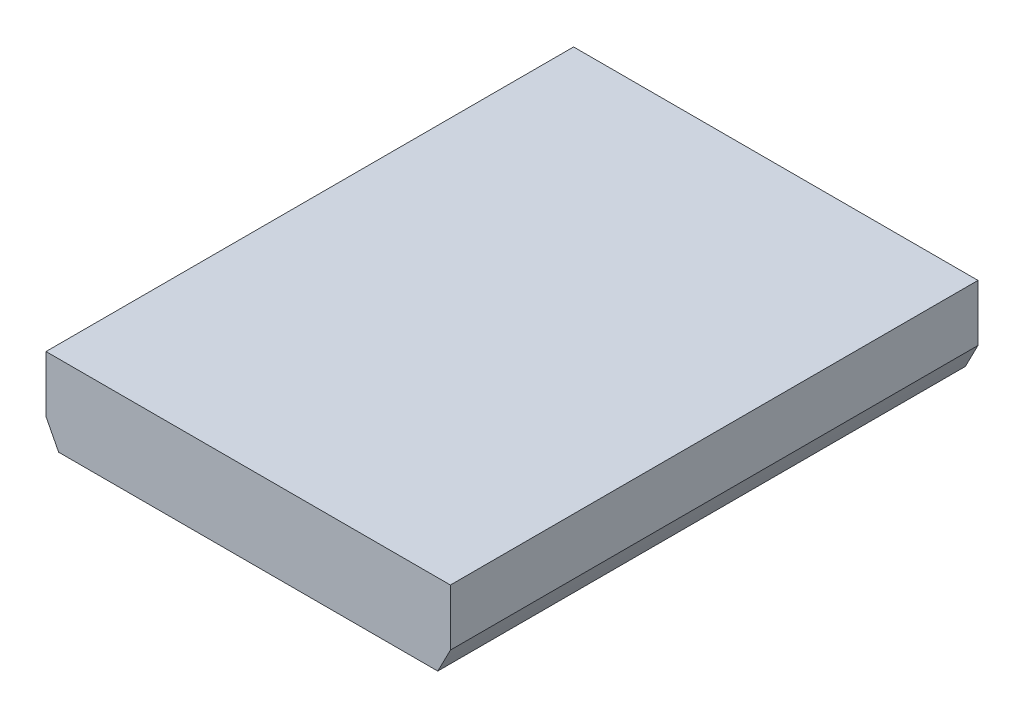
ISO-10303-21;
HEADER;
FILE_DESCRIPTION(('STEP AP214'),'2;1');
FILE_NAME('part.step','',(''),(''),'','','');
FILE_SCHEMA(('AUTOMOTIVE_DESIGN { 1 0 10303 214 1 1 1 1 }'));
ENDSEC;
DATA;
#1=APPLICATION_CONTEXT('core data for automotive mechanical design processes');
#2=APPLICATION_PROTOCOL_DEFINITION('international standard','automotive_design',2000,#1);
#3=PRODUCT_CONTEXT('',#1,'mechanical');
#4=PRODUCT('Part','Part','',(#3));
#5=PRODUCT_RELATED_PRODUCT_CATEGORY('part','',(#4));
#6=PRODUCT_DEFINITION_FORMATION('','',#4);
#7=PRODUCT_DEFINITION_CONTEXT('part definition',#1,'design');
#8=PRODUCT_DEFINITION('design','',#6,#7);
#9=PRODUCT_DEFINITION_SHAPE('','',#8);
#10=(LENGTH_UNIT() NAMED_UNIT(*) SI_UNIT(.MILLI.,.METRE.));
#11=(NAMED_UNIT(*) PLANE_ANGLE_UNIT() SI_UNIT($,.RADIAN.));
#12=(NAMED_UNIT(*) SI_UNIT($,.STERADIAN.) SOLID_ANGLE_UNIT());
#13=UNCERTAINTY_MEASURE_WITH_UNIT(LENGTH_MEASURE(1.E-05),#10,'distance_accuracy_value','');
#14=(GEOMETRIC_REPRESENTATION_CONTEXT(3) GLOBAL_UNCERTAINTY_ASSIGNED_CONTEXT((#13)) GLOBAL_UNIT_ASSIGNED_CONTEXT((#10,
#11,#12)) REPRESENTATION_CONTEXT('',''));
#15=CARTESIAN_POINT('',(0.,0.,0.));
#16=DIRECTION('',(0.,0.,1.));
#17=DIRECTION('',(1.,0.,0.));
#18=AXIS2_PLACEMENT_3D('',#15,#16,#17);
#19=CARTESIAN_POINT('',(-127.000000000214,127.000000000428,331.382));
#20=CARTESIAN_POINT('',(-3.79340656109228E-11,-127.000000000353,331.382));
#21=CARTESIAN_POINT('',(127.000000000138,127.000000000277,331.382));
#22=B_SPLINE_CURVE_WITH_KNOTS('',2,(#19,#20,#21),.UNSPECIFIED.,.F.,.F.,(3,3),
(0.0560283962320779,0.943971603767657),.UNSPECIFIED.);
#23=DIRECTION('',(0.,0.,-1.));
#24=VECTOR('',#23,1.);
#25=SURFACE_OF_LINEAR_EXTRUSION('',#22,#24);
#26=CARTESIAN_POINT('',(-127.000000000214,127.000000000428,0.));
#27=CARTESIAN_POINT('',(-3.79340656109228E-11,-127.000000000353,0.));
#28=CARTESIAN_POINT('',(127.000000000138,127.000000000277,0.));
#29=B_SPLINE_CURVE_WITH_KNOTS('',2,(#26,#27,#28),.UNSPECIFIED.,.F.,.F.,(3,3),
(0.0560283962320779,0.943971603767657),.UNSPECIFIED.);
#30=CARTESIAN_POINT('',(-127.000000000171,127.000000000343,0.));
#31=VERTEX_POINT('',#30);
#32=CARTESIAN_POINT('',(-119.051249468448,111.599999999989,0.));
#33=VERTEX_POINT('',#32);
#34=EDGE_CURVE('E135',#31,#33,#29,.T.);
#35=ORIENTED_EDGE('',*,*,#34,.T.);
#36=DIRECTION('',(0.,0.,-1.));
#37=VECTOR('',#36,1.);
#38=CARTESIAN_POINT('',(-119.051249468454,111.6,331.382));
#39=LINE('',#38,#37);
#40=CARTESIAN_POINT('',(-119.051249468448,111.6,331.382));
#41=VERTEX_POINT('',#40);
#42=EDGE_CURVE('E49',#33,#41,#39,.F.);
#43=ORIENTED_EDGE('',*,*,#42,.T.);
#44=CARTESIAN_POINT('',(-127.000000000171,127.000000000343,331.382));
#45=VERTEX_POINT('',#44);
#46=EDGE_CURVE('E151',#45,#41,#22,.T.);
#47=ORIENTED_EDGE('',*,*,#46,.F.);
#48=DIRECTION('',(0.,0.,-1.));
#49=VECTOR('',#48,1.);
#50=CARTESIAN_POINT('',(-127.000000000171,127.000000000343,331.382));
#51=LINE('',#50,#49);
#52=EDGE_CURVE('E149',#45,#31,#51,.T.);
#53=ORIENTED_EDGE('',*,*,#52,.T.);
#54=EDGE_LOOP('',(#35,#43,#47,#53));
#55=FACE_BOUND('',#54,.T.);
#56=ADVANCED_FACE('F33',(#55),#25,.F.);
#57=CARTESIAN_POINT('',(119.051249468448,111.6,331.382));
#58=VERTEX_POINT('',#57);
#59=CARTESIAN_POINT('',(127.000000000094,127.000000000343,331.382));
#60=VERTEX_POINT('',#59);
#61=EDGE_CURVE('E145',#58,#60,#22,.T.);
#62=ORIENTED_EDGE('',*,*,#61,.F.);
#63=DIRECTION('',(0.,0.,-1.));
#64=VECTOR('',#63,1.);
#65=CARTESIAN_POINT('',(119.051249468454,111.6,331.382));
#66=LINE('',#65,#64);
#67=CARTESIAN_POINT('',(119.051249468448,111.6,0.));
#68=VERTEX_POINT('',#67);
#69=EDGE_CURVE('E198',#58,#68,#66,.T.);
#70=ORIENTED_EDGE('',*,*,#69,.T.);
#71=CARTESIAN_POINT('',(127.000000000094,127.000000000343,0.));
#72=VERTEX_POINT('',#71);
#73=EDGE_CURVE('E146',#68,#72,#29,.T.);
#74=ORIENTED_EDGE('',*,*,#73,.T.);
#75=DIRECTION('',(0.,0.,-1.));
#76=VECTOR('',#75,1.);
#77=CARTESIAN_POINT('',(127.000000000094,127.000000000343,331.382));
#78=LINE('',#77,#76);
#79=EDGE_CURVE('E42',#60,#72,#78,.T.);
#80=ORIENTED_EDGE('',*,*,#79,.F.);
#81=EDGE_LOOP('',(#62,#70,#74,#80));
#82=FACE_BOUND('',#81,.T.);
#83=ADVANCED_FACE('F35',(#82),#25,.F.);
#84=CARTESIAN_POINT('',(-3.79349329726608E-11,0.,331.382));
#85=DIRECTION('',(0.,0.,-1.));
#86=DIRECTION('',(-1.,0.,0.));
#87=AXIS2_PLACEMENT_3D('',#84,#85,#86);
#88=PLANE('',#87);
#89=ORIENTED_EDGE('',*,*,#46,.T.);
#90=DIRECTION('',(1.,0.,0.));
#91=VECTOR('',#90,1.);
#92=CARTESIAN_POINT('',(120.,111.6,331.382));
#93=LINE('',#92,#91);
#94=EDGE_CURVE('E176',#41,#58,#93,.T.);
#95=ORIENTED_EDGE('',*,*,#94,.T.);
#96=ORIENTED_EDGE('',*,*,#61,.T.);
#97=DIRECTION('',(0.,1.,0.));
#98=VECTOR('',#97,1.);
#99=CARTESIAN_POINT('',(127.000000000094,127.000000000343,331.382));
#100=LINE('',#99,#98);
#101=CARTESIAN_POINT('',(127.000000000094,162.400000000343,331.382));
#102=VERTEX_POINT('',#101);
#103=EDGE_CURVE('E165',#60,#102,#100,.T.);
#104=ORIENTED_EDGE('',*,*,#103,.T.);
#105=DIRECTION('',(-1.,0.,0.));
#106=VECTOR('',#105,1.);
#107=CARTESIAN_POINT('',(-127.000000000171,162.400000000343,331.382));
#108=LINE('',#107,#106);
#109=CARTESIAN_POINT('',(-127.000000000171,162.400000000343,331.382));
#110=VERTEX_POINT('',#109);
#111=EDGE_CURVE('E159',#102,#110,#108,.T.);
#112=ORIENTED_EDGE('',*,*,#111,.T.);
#113=DIRECTION('',(0.,-1.,0.));
#114=VECTOR('',#113,1.);
#115=CARTESIAN_POINT('',(-127.000000000171,127.000000000343,331.382));
#116=LINE('',#115,#114);
#117=EDGE_CURVE('E170',#110,#45,#116,.T.);
#118=ORIENTED_EDGE('',*,*,#117,.T.);
#119=EDGE_LOOP('',(#89,#95,#96,#104,#112,#118));
#120=FACE_BOUND('',#119,.T.);
#121=ADVANCED_FACE('F272',(#120),#88,.F.);
#122=CARTESIAN_POINT('',(-3.79349329726608E-11,0.,0.));
#123=DIRECTION('',(0.,0.,-1.));
#124=DIRECTION('',(-1.,0.,0.));
#125=AXIS2_PLACEMENT_3D('',#122,#123,#124);
#126=PLANE('',#125);
#127=DIRECTION('',(1.,0.,0.));
#128=VECTOR('',#127,1.);
#129=CARTESIAN_POINT('',(120.,111.6,0.));
#130=LINE('',#129,#128);
#131=EDGE_CURVE('E143',#33,#68,#130,.T.);
#132=ORIENTED_EDGE('',*,*,#131,.F.);
#133=ORIENTED_EDGE('',*,*,#34,.F.);
#134=DIRECTION('',(0.,-1.,0.));
#135=VECTOR('',#134,1.);
#136=CARTESIAN_POINT('',(-127.000000000171,127.000000000343,0.));
#137=LINE('',#136,#135);
#138=CARTESIAN_POINT('',(-127.000000000171,162.400000000343,0.));
#139=VERTEX_POINT('',#138);
#140=EDGE_CURVE('E140',#139,#31,#137,.T.);
#141=ORIENTED_EDGE('',*,*,#140,.F.);
#142=DIRECTION('',(-1.,0.,0.));
#143=VECTOR('',#142,1.);
#144=CARTESIAN_POINT('',(-127.000000000171,162.400000000343,0.));
#145=LINE('',#144,#143);
#146=CARTESIAN_POINT('',(127.000000000094,162.400000000343,0.));
#147=VERTEX_POINT('',#146);
#148=EDGE_CURVE('E162',#147,#139,#145,.T.);
#149=ORIENTED_EDGE('',*,*,#148,.F.);
#150=DIRECTION('',(0.,1.,0.));
#151=VECTOR('',#150,1.);
#152=CARTESIAN_POINT('',(127.000000000094,127.000000000343,0.));
#153=LINE('',#152,#151);
#154=EDGE_CURVE('E158',#72,#147,#153,.T.);
#155=ORIENTED_EDGE('',*,*,#154,.F.);
#156=ORIENTED_EDGE('',*,*,#73,.F.);
#157=EDGE_LOOP('',(#132,#133,#141,#149,#155,#156));
#158=FACE_BOUND('',#157,.T.);
#159=ADVANCED_FACE('F137',(#158),#126,.T.);
#160=CARTESIAN_POINT('',(-33.,-3.79141162909491E-11,21.8455));
#161=DIRECTION('',(-1.,0.,0.));
#162=DIRECTION('',(0.,0.,1.));
#163=AXIS2_PLACEMENT_3D('',#160,#161,#162);
#164=PLANE('',#163);
#165=DIRECTION('',(0.,1.,0.));
#166=VECTOR('',#165,1.);
#167=CARTESIAN_POINT('',(-33.,-3.79141162909491E-11,143.8455));
#168=LINE('',#167,#166);
#169=CARTESIAN_POINT('',(-33.,111.6,143.8455));
#170=VERTEX_POINT('',#169);
#171=CARTESIAN_POINT('',(-33.,127.000000000343,143.8455));
#172=VERTEX_POINT('',#171);
#173=EDGE_CURVE('E238',#170,#172,#168,.T.);
#174=ORIENTED_EDGE('',*,*,#173,.F.);
#175=DIRECTION('',(0.,0.,-1.));
#176=VECTOR('',#175,1.);
#177=CARTESIAN_POINT('',(-33.,111.6,21.8455));
#178=LINE('',#177,#176);
#179=CARTESIAN_POINT('',(-33.,111.6,21.8455));
#180=VERTEX_POINT('',#179);
#181=EDGE_CURVE('E57',#170,#180,#178,.T.);
#182=ORIENTED_EDGE('',*,*,#181,.T.);
#183=DIRECTION('',(0.,1.,0.));
#184=VECTOR('',#183,1.);
#185=CARTESIAN_POINT('',(-33.,-3.79141162909491E-11,21.8455));
#186=LINE('',#185,#184);
#187=CARTESIAN_POINT('',(-33.,127.000000000343,21.8455));
#188=VERTEX_POINT('',#187);
#189=EDGE_CURVE('E239',#180,#188,#186,.T.);
#190=ORIENTED_EDGE('',*,*,#189,.T.);
#191=DIRECTION('',(0.,0.,1.));
#192=VECTOR('',#191,1.);
#193=CARTESIAN_POINT('',(-33.,127.000000000343,21.8455));
#194=LINE('',#193,#192);
#195=EDGE_CURVE('E218',#188,#172,#194,.T.);
#196=ORIENTED_EDGE('',*,*,#195,.T.);
#197=EDGE_LOOP('',(#174,#182,#190,#196));
#198=FACE_BOUND('',#197,.T.);
#199=ADVANCED_FACE('F302',(#198),#164,.F.);
#200=CARTESIAN_POINT('',(-33.,-3.79141162909491E-11,21.8455));
#201=DIRECTION('',(0.,0.,-1.));
#202=DIRECTION('',(-1.,0.,0.));
#203=AXIS2_PLACEMENT_3D('',#200,#201,#202);
#204=PLANE('',#203);
#205=ORIENTED_EDGE('',*,*,#189,.F.);
#206=DIRECTION('',(1.,0.,0.));
#207=VECTOR('',#206,1.);
#208=CARTESIAN_POINT('',(-33.,111.6,21.8455));
#209=LINE('',#208,#207);
#210=CARTESIAN_POINT('',(33.,111.6,21.8455));
#211=VERTEX_POINT('',#210);
#212=EDGE_CURVE('E194',#180,#211,#209,.T.);
#213=ORIENTED_EDGE('',*,*,#212,.T.);
#214=DIRECTION('',(0.,1.,0.));
#215=VECTOR('',#214,1.);
#216=CARTESIAN_POINT('',(33.,-3.79141162909491E-11,21.8455));
#217=LINE('',#216,#215);
#218=CARTESIAN_POINT('',(33.,127.000000000343,21.8455));
#219=VERTEX_POINT('',#218);
#220=EDGE_CURVE('E242',#211,#219,#217,.T.);
#221=ORIENTED_EDGE('',*,*,#220,.T.);
#222=DIRECTION('',(-1.,0.,0.));
#223=VECTOR('',#222,1.);
#224=CARTESIAN_POINT('',(-33.,127.000000000343,21.8455));
#225=LINE('',#224,#223);
#226=EDGE_CURVE('E235',#219,#188,#225,.T.);
#227=ORIENTED_EDGE('',*,*,#226,.T.);
#228=EDGE_LOOP('',(#205,#213,#221,#227));
#229=FACE_BOUND('',#228,.T.);
#230=ADVANCED_FACE('F306',(#229),#204,.F.);
#231=CARTESIAN_POINT('',(33.,-3.79141162909491E-11,21.8455));
#232=DIRECTION('',(1.,0.,0.));
#233=DIRECTION('',(0.,0.,-1.));
#234=AXIS2_PLACEMENT_3D('',#231,#232,#233);
#235=PLANE('',#234);
#236=ORIENTED_EDGE('',*,*,#220,.F.);
#237=DIRECTION('',(0.,0.,1.));
#238=VECTOR('',#237,1.);
#239=CARTESIAN_POINT('',(33.,111.6,21.8455));
#240=LINE('',#239,#238);
#241=CARTESIAN_POINT('',(33.,111.6,143.8455));
#242=VERTEX_POINT('',#241);
#243=EDGE_CURVE('E191',#211,#242,#240,.T.);
#244=ORIENTED_EDGE('',*,*,#243,.T.);
#245=DIRECTION('',(0.,1.,0.));
#246=VECTOR('',#245,1.);
#247=CARTESIAN_POINT('',(33.,-3.79141162909491E-11,143.8455));
#248=LINE('',#247,#246);
#249=CARTESIAN_POINT('',(33.,127.000000000343,143.8455));
#250=VERTEX_POINT('',#249);
#251=EDGE_CURVE('E245',#242,#250,#248,.T.);
#252=ORIENTED_EDGE('',*,*,#251,.T.);
#253=DIRECTION('',(0.,0.,-1.));
#254=VECTOR('',#253,1.);
#255=CARTESIAN_POINT('',(33.,127.000000000343,21.8455));
#256=LINE('',#255,#254);
#257=EDGE_CURVE('E232',#250,#219,#256,.T.);
#258=ORIENTED_EDGE('',*,*,#257,.T.);
#259=EDGE_LOOP('',(#236,#244,#252,#258));
#260=FACE_BOUND('',#259,.T.);
#261=ADVANCED_FACE('F312',(#260),#235,.F.);
#262=CARTESIAN_POINT('',(-33.,-3.79141162909491E-11,143.8455));
#263=DIRECTION('',(0.,0.,1.));
#264=DIRECTION('',(1.,0.,0.));
#265=AXIS2_PLACEMENT_3D('',#262,#263,#264);
#266=PLANE('',#265);
#267=ORIENTED_EDGE('',*,*,#251,.F.);
#268=DIRECTION('',(-1.,0.,0.));
#269=VECTOR('',#268,1.);
#270=CARTESIAN_POINT('',(-33.,111.6,143.8455));
#271=LINE('',#270,#269);
#272=EDGE_CURVE('E189',#242,#170,#271,.T.);
#273=ORIENTED_EDGE('',*,*,#272,.T.);
#274=ORIENTED_EDGE('',*,*,#173,.T.);
#275=DIRECTION('',(1.,0.,0.));
#276=VECTOR('',#275,1.);
#277=CARTESIAN_POINT('',(-33.,127.000000000343,143.8455));
#278=LINE('',#277,#276);
#279=EDGE_CURVE('E229',#172,#250,#278,.T.);
#280=ORIENTED_EDGE('',*,*,#279,.T.);
#281=EDGE_LOOP('',(#267,#273,#274,#280));
#282=FACE_BOUND('',#281,.T.);
#283=ADVANCED_FACE('F308',(#282),#266,.F.);
#284=CARTESIAN_POINT('',(-33.,-3.79141162909491E-11,187.5365));
#285=DIRECTION('',(-1.,0.,0.));
#286=DIRECTION('',(0.,0.,1.));
#287=AXIS2_PLACEMENT_3D('',#284,#285,#286);
#288=PLANE('',#287);
#289=DIRECTION('',(0.,1.,0.));
#290=VECTOR('',#289,1.);
#291=CARTESIAN_POINT('',(-33.,-3.79141162909491E-11,309.5365));
#292=LINE('',#291,#290);
#293=CARTESIAN_POINT('',(-33.,111.6,309.5365));
#294=VERTEX_POINT('',#293);
#295=CARTESIAN_POINT('',(-33.,127.000000000343,309.5365));
#296=VERTEX_POINT('',#295);
#297=EDGE_CURVE('E214',#294,#296,#292,.T.);
#298=ORIENTED_EDGE('',*,*,#297,.F.);
#299=DIRECTION('',(0.,0.,-1.));
#300=VECTOR('',#299,1.);
#301=CARTESIAN_POINT('',(-33.,111.6,187.5365));
#302=LINE('',#301,#300);
#303=CARTESIAN_POINT('',(-33.,111.6,187.5365));
#304=VERTEX_POINT('',#303);
#305=EDGE_CURVE('E186',#294,#304,#302,.T.);
#306=ORIENTED_EDGE('',*,*,#305,.T.);
#307=DIRECTION('',(0.,1.,0.));
#308=VECTOR('',#307,1.);
#309=CARTESIAN_POINT('',(-33.,-3.79141162909491E-11,187.5365));
#310=LINE('',#309,#308);
#311=CARTESIAN_POINT('',(-33.,127.000000000343,187.5365));
#312=VERTEX_POINT('',#311);
#313=EDGE_CURVE('E215',#304,#312,#310,.T.);
#314=ORIENTED_EDGE('',*,*,#313,.T.);
#315=DIRECTION('',(0.,0.,1.));
#316=VECTOR('',#315,1.);
#317=CARTESIAN_POINT('',(-33.,127.000000000343,187.5365));
#318=LINE('',#317,#316);
#319=EDGE_CURVE('E202',#312,#296,#318,.T.);
#320=ORIENTED_EDGE('',*,*,#319,.T.);
#321=EDGE_LOOP('',(#298,#306,#314,#320));
#322=FACE_BOUND('',#321,.T.);
#323=ADVANCED_FACE('F311',(#322),#288,.F.);
#324=CARTESIAN_POINT('',(-33.,-3.79141162909491E-11,187.5365));
#325=DIRECTION('',(0.,0.,-1.));
#326=DIRECTION('',(-1.,0.,0.));
#327=AXIS2_PLACEMENT_3D('',#324,#325,#326);
#328=PLANE('',#327);
#329=ORIENTED_EDGE('',*,*,#313,.F.);
#330=DIRECTION('',(1.,0.,0.));
#331=VECTOR('',#330,1.);
#332=CARTESIAN_POINT('',(-33.,111.6,187.5365));
#333=LINE('',#332,#331);
#334=CARTESIAN_POINT('',(33.,111.6,187.5365));
#335=VERTEX_POINT('',#334);
#336=EDGE_CURVE('E183',#304,#335,#333,.T.);
#337=ORIENTED_EDGE('',*,*,#336,.T.);
#338=DIRECTION('',(0.,1.,0.));
#339=VECTOR('',#338,1.);
#340=CARTESIAN_POINT('',(33.,-3.79141162909491E-11,187.5365));
#341=LINE('',#340,#339);
#342=CARTESIAN_POINT('',(33.,127.000000000343,187.5365));
#343=VERTEX_POINT('',#342);
#344=EDGE_CURVE('E219',#335,#343,#341,.T.);
#345=ORIENTED_EDGE('',*,*,#344,.T.);
#346=DIRECTION('',(-1.,0.,0.));
#347=VECTOR('',#346,1.);
#348=CARTESIAN_POINT('',(-33.,127.000000000343,187.5365));
#349=LINE('',#348,#347);
#350=EDGE_CURVE('E211',#343,#312,#349,.T.);
#351=ORIENTED_EDGE('',*,*,#350,.T.);
#352=EDGE_LOOP('',(#329,#337,#345,#351));
#353=FACE_BOUND('',#352,.T.);
#354=ADVANCED_FACE('F321',(#353),#328,.F.);
#355=CARTESIAN_POINT('',(33.,-3.79141162909491E-11,187.5365));
#356=DIRECTION('',(1.,0.,0.));
#357=DIRECTION('',(0.,0.,-1.));
#358=AXIS2_PLACEMENT_3D('',#355,#356,#357);
#359=PLANE('',#358);
#360=ORIENTED_EDGE('',*,*,#344,.F.);
#361=DIRECTION('',(0.,0.,1.));
#362=VECTOR('',#361,1.);
#363=CARTESIAN_POINT('',(33.,111.6,187.5365));
#364=LINE('',#363,#362);
#365=CARTESIAN_POINT('',(33.,111.6,309.5365));
#366=VERTEX_POINT('',#365);
#367=EDGE_CURVE('E179',#335,#366,#364,.T.);
#368=ORIENTED_EDGE('',*,*,#367,.T.);
#369=DIRECTION('',(0.,1.,0.));
#370=VECTOR('',#369,1.);
#371=CARTESIAN_POINT('',(33.,-3.79141162909491E-11,309.5365));
#372=LINE('',#371,#370);
#373=CARTESIAN_POINT('',(33.,127.000000000343,309.5365));
#374=VERTEX_POINT('',#373);
#375=EDGE_CURVE('E222',#366,#374,#372,.T.);
#376=ORIENTED_EDGE('',*,*,#375,.T.);
#377=DIRECTION('',(0.,0.,-1.));
#378=VECTOR('',#377,1.);
#379=CARTESIAN_POINT('',(33.,127.000000000343,187.5365));
#380=LINE('',#379,#378);
#381=EDGE_CURVE('E208',#374,#343,#380,.T.);
#382=ORIENTED_EDGE('',*,*,#381,.T.);
#383=EDGE_LOOP('',(#360,#368,#376,#382));
#384=FACE_BOUND('',#383,.T.);
#385=ADVANCED_FACE('F286',(#384),#359,.F.);
#386=CARTESIAN_POINT('',(-33.,-3.79141162909491E-11,309.5365));
#387=DIRECTION('',(0.,0.,1.));
#388=DIRECTION('',(1.,0.,0.));
#389=AXIS2_PLACEMENT_3D('',#386,#387,#388);
#390=PLANE('',#389);
#391=ORIENTED_EDGE('',*,*,#375,.F.);
#392=DIRECTION('',(-1.,0.,0.));
#393=VECTOR('',#392,1.);
#394=CARTESIAN_POINT('',(-33.,111.6,309.5365));
#395=LINE('',#394,#393);
#396=EDGE_CURVE('E11',#366,#294,#395,.T.);
#397=ORIENTED_EDGE('',*,*,#396,.T.);
#398=ORIENTED_EDGE('',*,*,#297,.T.);
#399=DIRECTION('',(1.,0.,0.));
#400=VECTOR('',#399,1.);
#401=CARTESIAN_POINT('',(-33.,127.000000000343,309.5365));
#402=LINE('',#401,#400);
#403=EDGE_CURVE('E205',#296,#374,#402,.T.);
#404=ORIENTED_EDGE('',*,*,#403,.T.);
#405=EDGE_LOOP('',(#391,#397,#398,#404));
#406=FACE_BOUND('',#405,.T.);
#407=ADVANCED_FACE('F276',(#406),#390,.F.);
#408=CARTESIAN_POINT('',(120.,111.6,331.382));
#409=DIRECTION('',(0.,1.,0.));
#410=DIRECTION('',(0.,0.,1.));
#411=AXIS2_PLACEMENT_3D('',#408,#409,#410);
#412=PLANE('',#411);
#413=ORIENTED_EDGE('',*,*,#396,.F.);
#414=ORIENTED_EDGE('',*,*,#367,.F.);
#415=ORIENTED_EDGE('',*,*,#336,.F.);
#416=ORIENTED_EDGE('',*,*,#305,.F.);
#417=EDGE_LOOP('',(#413,#414,#415,#416));
#418=FACE_BOUND('',#417,.T.);
#419=ORIENTED_EDGE('',*,*,#272,.F.);
#420=ORIENTED_EDGE('',*,*,#243,.F.);
#421=ORIENTED_EDGE('',*,*,#212,.F.);
#422=ORIENTED_EDGE('',*,*,#181,.F.);
#423=EDGE_LOOP('',(#419,#420,#421,#422));
#424=FACE_BOUND('',#423,.T.);
#425=ORIENTED_EDGE('',*,*,#131,.T.);
#426=ORIENTED_EDGE('',*,*,#69,.F.);
#427=ORIENTED_EDGE('',*,*,#94,.F.);
#428=ORIENTED_EDGE('',*,*,#42,.F.);
#429=EDGE_LOOP('',(#425,#426,#427,#428));
#430=FACE_BOUND('',#429,.T.);
#431=ADVANCED_FACE('F273',(#418,#424,#430),#412,.F.);
#432=CARTESIAN_POINT('',(-127.000000000171,127.000000000343,0.));
#433=DIRECTION('',(0.,-1.,0.));
#434=DIRECTION('',(0.,0.,-1.));
#435=AXIS2_PLACEMENT_3D('',#432,#433,#434);
#436=PLANE('',#435);
#437=ORIENTED_EDGE('',*,*,#319,.F.);
#438=ORIENTED_EDGE('',*,*,#350,.F.);
#439=ORIENTED_EDGE('',*,*,#381,.F.);
#440=ORIENTED_EDGE('',*,*,#403,.F.);
#441=EDGE_LOOP('',(#437,#438,#439,#440));
#442=FACE_BOUND('',#441,.T.);
#443=ADVANCED_FACE('F275',(#442),#436,.T.);
#444=ORIENTED_EDGE('',*,*,#195,.F.);
#445=ORIENTED_EDGE('',*,*,#226,.F.);
#446=ORIENTED_EDGE('',*,*,#257,.F.);
#447=ORIENTED_EDGE('',*,*,#279,.F.);
#448=EDGE_LOOP('',(#444,#445,#446,#447));
#449=FACE_BOUND('',#448,.T.);
#450=ADVANCED_FACE('F283',(#449),#436,.T.);
#451=CARTESIAN_POINT('',(-127.000000000171,127.000000000343,0.));
#452=DIRECTION('',(-1.,0.,0.));
#453=DIRECTION('',(0.,0.,1.));
#454=AXIS2_PLACEMENT_3D('',#451,#452,#453);
#455=PLANE('',#454);
#456=ORIENTED_EDGE('',*,*,#117,.F.);
#457=DIRECTION('',(0.,0.,1.));
#458=VECTOR('',#457,1.);
#459=CARTESIAN_POINT('',(-127.000000000171,162.400000000343,0.));
#460=LINE('',#459,#458);
#461=EDGE_CURVE('E157',#139,#110,#460,.T.);
#462=ORIENTED_EDGE('',*,*,#461,.F.);
#463=ORIENTED_EDGE('',*,*,#140,.T.);
#464=ORIENTED_EDGE('',*,*,#52,.F.);
#465=EDGE_LOOP('',(#456,#462,#463,#464));
#466=FACE_BOUND('',#465,.T.);
#467=ADVANCED_FACE('F156',(#466),#455,.T.);
#468=CARTESIAN_POINT('',(-127.000000000171,162.400000000343,0.));
#469=DIRECTION('',(0.,1.,0.));
#470=DIRECTION('',(0.,0.,1.));
#471=AXIS2_PLACEMENT_3D('',#468,#469,#470);
#472=PLANE('',#471);
#473=ORIENTED_EDGE('',*,*,#111,.F.);
#474=DIRECTION('',(0.,0.,1.));
#475=VECTOR('',#474,1.);
#476=CARTESIAN_POINT('',(127.000000000094,162.400000000343,0.));
#477=LINE('',#476,#475);
#478=EDGE_CURVE('E169',#147,#102,#477,.T.);
#479=ORIENTED_EDGE('',*,*,#478,.F.);
#480=ORIENTED_EDGE('',*,*,#148,.T.);
#481=ORIENTED_EDGE('',*,*,#461,.T.);
#482=EDGE_LOOP('',(#473,#479,#480,#481));
#483=FACE_BOUND('',#482,.T.);
#484=ADVANCED_FACE('F270',(#483),#472,.T.);
#485=CARTESIAN_POINT('',(127.000000000094,127.000000000343,0.));
#486=DIRECTION('',(1.,0.,0.));
#487=DIRECTION('',(0.,0.,-1.));
#488=AXIS2_PLACEMENT_3D('',#485,#486,#487);
#489=PLANE('',#488);
#490=ORIENTED_EDGE('',*,*,#103,.F.);
#491=ORIENTED_EDGE('',*,*,#79,.T.);
#492=ORIENTED_EDGE('',*,*,#154,.T.);
#493=ORIENTED_EDGE('',*,*,#478,.T.);
#494=EDGE_LOOP('',(#490,#491,#492,#493));
#495=FACE_BOUND('',#494,.T.);
#496=ADVANCED_FACE('F265',(#495),#489,.T.);
#497=CLOSED_SHELL('',(#56,#83,#121,#159,#199,#230,#261,#283,#323,#354,#385,#407,#431,#443,#450,
#467,#484,#496));
#498=MANIFOLD_SOLID_BREP('B2',#497);
#499=ADVANCED_BREP_SHAPE_REPRESENTATION('',(#18,#498),#14);
#500=SHAPE_DEFINITION_REPRESENTATION(#9,#499);
ENDSEC;
END-ISO-10303-21;
